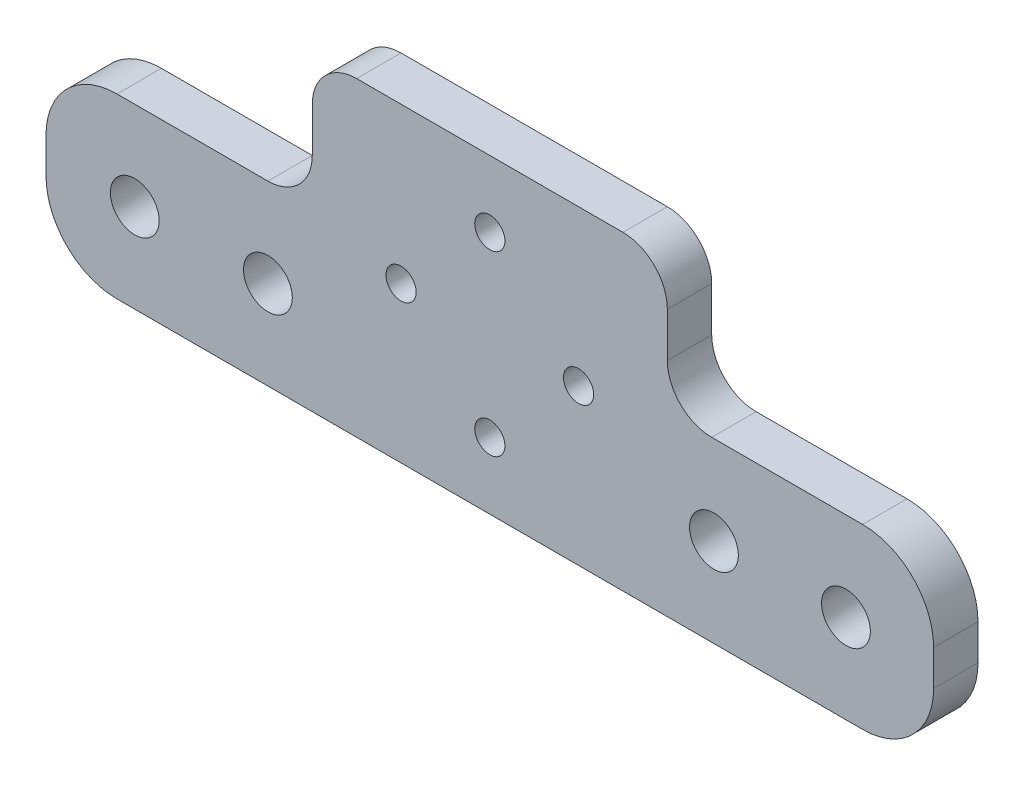
ISO-10303-21;
HEADER;
FILE_DESCRIPTION(('STEP AP214'),'2;1');
FILE_NAME('part.step','',(''),(''),'','','');
FILE_SCHEMA(('AUTOMOTIVE_DESIGN { 1 0 10303 214 1 1 1 1 }'));
ENDSEC;
DATA;
#1=APPLICATION_CONTEXT('core data for automotive mechanical design processes');
#2=APPLICATION_PROTOCOL_DEFINITION('international standard','automotive_design',2000,#1);
#3=PRODUCT_CONTEXT('',#1,'mechanical');
#4=PRODUCT('Part','Part','',(#3));
#5=PRODUCT_RELATED_PRODUCT_CATEGORY('part','',(#4));
#6=PRODUCT_DEFINITION_FORMATION('','',#4);
#7=PRODUCT_DEFINITION_CONTEXT('part definition',#1,'design');
#8=PRODUCT_DEFINITION('design','',#6,#7);
#9=PRODUCT_DEFINITION_SHAPE('','',#8);
#10=(LENGTH_UNIT() NAMED_UNIT(*) SI_UNIT(.MILLI.,.METRE.));
#11=(NAMED_UNIT(*) PLANE_ANGLE_UNIT() SI_UNIT($,.RADIAN.));
#12=(NAMED_UNIT(*) SI_UNIT($,.STERADIAN.) SOLID_ANGLE_UNIT());
#13=UNCERTAINTY_MEASURE_WITH_UNIT(LENGTH_MEASURE(1.E-05),#10,'distance_accuracy_value','');
#14=(GEOMETRIC_REPRESENTATION_CONTEXT(3) GLOBAL_UNCERTAINTY_ASSIGNED_CONTEXT((#13)) GLOBAL_UNIT_ASSIGNED_CONTEXT((#10,
#11,#12)) REPRESENTATION_CONTEXT('',''));
#15=CARTESIAN_POINT('',(0.,0.,0.));
#16=DIRECTION('',(0.,0.,1.));
#17=DIRECTION('',(1.,0.,0.));
#18=AXIS2_PLACEMENT_3D('',#15,#16,#17);
#19=CARTESIAN_POINT('',(-25.,25.,0.));
#20=DIRECTION('',(0.,0.,1.));
#21=DIRECTION('',(1.,0.,0.));
#22=AXIS2_PLACEMENT_3D('',#19,#20,#21);
#23=PLANE('',#22);
#24=CARTESIAN_POINT('',(0.,7.5,0.));
#25=DIRECTION('',(0.,0.,-1.));
#26=DIRECTION('',(-1.,0.,0.));
#27=AXIS2_PLACEMENT_3D('',#24,#25,#26);
#28=CIRCLE('',#27,3.15);
#29=CARTESIAN_POINT('',(-3.15,7.5,0.));
#30=VERTEX_POINT('',#29);
#31=EDGE_CURVE('E379',#30,#30,#28,.T.);
#32=ORIENTED_EDGE('',*,*,#31,.F.);
#33=EDGE_LOOP('',(#32));
#34=FACE_BOUND('',#33,.T.);
#35=CARTESIAN_POINT('',(-40.,9.99999999999996,0.));
#36=DIRECTION('',(0.,0.,1.));
#37=DIRECTION('',(1.,0.,0.));
#38=AXIS2_PLACEMENT_3D('',#35,#36,#37);
#39=CIRCLE('',#38,2.75);
#40=CARTESIAN_POINT('',(-37.25,9.99999999999996,0.));
#41=VERTEX_POINT('',#40);
#42=EDGE_CURVE('E409',#41,#41,#39,.T.);
#43=ORIENTED_EDGE('',*,*,#42,.T.);
#44=EDGE_LOOP('',(#43));
#45=FACE_BOUND('',#44,.T.);
#46=CARTESIAN_POINT('',(-25.,9.99999999999995,0.));
#47=DIRECTION('',(0.,0.,1.));
#48=DIRECTION('',(1.,0.,0.));
#49=AXIS2_PLACEMENT_3D('',#46,#47,#48);
#50=CIRCLE('',#49,2.74999999999999);
#51=CARTESIAN_POINT('',(-22.25,9.99999999999995,0.));
#52=VERTEX_POINT('',#51);
#53=EDGE_CURVE('E415',#52,#52,#50,.T.);
#54=ORIENTED_EDGE('',*,*,#53,.T.);
#55=EDGE_LOOP('',(#54));
#56=FACE_BOUND('',#55,.T.);
#57=CARTESIAN_POINT('',(25.25,9.99999999999995,0.));
#58=DIRECTION('',(0.,0.,1.));
#59=DIRECTION('',(1.,0.,0.));
#60=AXIS2_PLACEMENT_3D('',#57,#58,#59);
#61=CIRCLE('',#60,2.74999999999999);
#62=CARTESIAN_POINT('',(28.,9.99999999999995,0.));
#63=VERTEX_POINT('',#62);
#64=EDGE_CURVE('E421',#63,#63,#61,.T.);
#65=ORIENTED_EDGE('',*,*,#64,.T.);
#66=EDGE_LOOP('',(#65));
#67=FACE_BOUND('',#66,.T.);
#68=CARTESIAN_POINT('',(40.125,9.99999999999996,0.));
#69=DIRECTION('',(0.,0.,1.));
#70=DIRECTION('',(1.,0.,0.));
#71=AXIS2_PLACEMENT_3D('',#68,#69,#70);
#72=CIRCLE('',#71,2.74999999999999);
#73=CARTESIAN_POINT('',(42.875,9.99999999999996,0.));
#74=VERTEX_POINT('',#73);
#75=EDGE_CURVE('E182',#74,#74,#72,.T.);
#76=ORIENTED_EDGE('',*,*,#75,.T.);
#77=EDGE_LOOP('',(#76));
#78=FACE_BOUND('',#77,.T.);
#79=CARTESIAN_POINT('',(-25.,25.,0.));
#80=DIRECTION('',(0.,0.,-1.));
#81=DIRECTION('',(1.,0.,0.));
#82=AXIS2_PLACEMENT_3D('',#79,#80,#81);
#83=CIRCLE('',#82,5.);
#84=CARTESIAN_POINT('',(-20.,25.,0.));
#85=VERTEX_POINT('',#84);
#86=CARTESIAN_POINT('',(-25.,20.,0.));
#87=VERTEX_POINT('',#86);
#88=EDGE_CURVE('E178',#85,#87,#83,.T.);
#89=ORIENTED_EDGE('',*,*,#88,.F.);
#90=DIRECTION('',(0.,-1.,0.));
#91=VECTOR('',#90,1.);
#92=CARTESIAN_POINT('',(-20.,25.,0.));
#93=LINE('',#92,#91);
#94=CARTESIAN_POINT('',(-20.,30.,0.));
#95=VERTEX_POINT('',#94);
#96=EDGE_CURVE('E109',#95,#85,#93,.T.);
#97=ORIENTED_EDGE('',*,*,#96,.F.);
#98=CARTESIAN_POINT('',(-15.,30.,0.));
#99=DIRECTION('',(0.,0.,1.));
#100=DIRECTION('',(-1.,0.,0.));
#101=AXIS2_PLACEMENT_3D('',#98,#99,#100);
#102=CIRCLE('',#101,5.);
#103=CARTESIAN_POINT('',(-15.,35.,0.));
#104=VERTEX_POINT('',#103);
#105=EDGE_CURVE('E103',#104,#95,#102,.T.);
#106=ORIENTED_EDGE('',*,*,#105,.F.);
#107=DIRECTION('',(-1.,0.,0.));
#108=VECTOR('',#107,1.);
#109=CARTESIAN_POINT('',(-15.,35.,0.));
#110=LINE('',#109,#108);
#111=CARTESIAN_POINT('',(15.,35.,0.));
#112=VERTEX_POINT('',#111);
#113=EDGE_CURVE('E168',#112,#104,#110,.T.);
#114=ORIENTED_EDGE('',*,*,#113,.F.);
#115=CARTESIAN_POINT('',(15.,30.,0.));
#116=DIRECTION('',(0.,0.,1.));
#117=DIRECTION('',(1.,0.,0.));
#118=AXIS2_PLACEMENT_3D('',#115,#116,#117);
#119=CIRCLE('',#118,5.);
#120=CARTESIAN_POINT('',(20.,30.,0.));
#121=VERTEX_POINT('',#120);
#122=EDGE_CURVE('E204',#121,#112,#119,.T.);
#123=ORIENTED_EDGE('',*,*,#122,.F.);
#124=DIRECTION('',(0.,1.,0.));
#125=VECTOR('',#124,1.);
#126=CARTESIAN_POINT('',(20.,25.,0.));
#127=LINE('',#126,#125);
#128=CARTESIAN_POINT('',(20.,25.,0.));
#129=VERTEX_POINT('',#128);
#130=EDGE_CURVE('E202',#129,#121,#127,.T.);
#131=ORIENTED_EDGE('',*,*,#130,.F.);
#132=CARTESIAN_POINT('',(25.,25.,0.));
#133=DIRECTION('',(0.,0.,-1.));
#134=DIRECTION('',(-1.,0.,0.));
#135=AXIS2_PLACEMENT_3D('',#132,#133,#134);
#136=CIRCLE('',#135,5.);
#137=CARTESIAN_POINT('',(25.,20.,0.));
#138=VERTEX_POINT('',#137);
#139=EDGE_CURVE('E200',#138,#129,#136,.T.);
#140=ORIENTED_EDGE('',*,*,#139,.F.);
#141=DIRECTION('',(-1.,0.,0.));
#142=VECTOR('',#141,1.);
#143=CARTESIAN_POINT('',(42.,20.,0.));
#144=LINE('',#143,#142);
#145=CARTESIAN_POINT('',(42.,20.,0.));
#146=VERTEX_POINT('',#145);
#147=EDGE_CURVE('E198',#146,#138,#144,.T.);
#148=ORIENTED_EDGE('',*,*,#147,.F.);
#149=CARTESIAN_POINT('',(42.,12.,0.));
#150=DIRECTION('',(0.,0.,1.));
#151=DIRECTION('',(1.,0.,0.));
#152=AXIS2_PLACEMENT_3D('',#149,#150,#151);
#153=CIRCLE('',#152,8.);
#154=CARTESIAN_POINT('',(50.,11.9999999999999,0.));
#155=VERTEX_POINT('',#154);
#156=EDGE_CURVE('E196',#155,#146,#153,.T.);
#157=ORIENTED_EDGE('',*,*,#156,.F.);
#158=DIRECTION('',(0.,1.,0.));
#159=VECTOR('',#158,1.);
#160=CARTESIAN_POINT('',(50.,8.00000000000005,0.));
#161=LINE('',#160,#159);
#162=CARTESIAN_POINT('',(50.,7.99999999999999,0.));
#163=VERTEX_POINT('',#162);
#164=EDGE_CURVE('E194',#163,#155,#161,.T.);
#165=ORIENTED_EDGE('',*,*,#164,.F.);
#166=CARTESIAN_POINT('',(42.,7.99999999999999,0.));
#167=DIRECTION('',(0.,0.,1.));
#168=DIRECTION('',(1.,0.,0.));
#169=AXIS2_PLACEMENT_3D('',#166,#167,#168);
#170=CIRCLE('',#169,8.);
#171=CARTESIAN_POINT('',(42.,0.,0.));
#172=VERTEX_POINT('',#171);
#173=EDGE_CURVE('E192',#172,#163,#170,.T.);
#174=ORIENTED_EDGE('',*,*,#173,.F.);
#175=DIRECTION('',(1.,0.,0.));
#176=VECTOR('',#175,1.);
#177=CARTESIAN_POINT('',(42.,0.,0.));
#178=LINE('',#177,#176);
#179=CARTESIAN_POINT('',(-42.,0.,0.));
#180=VERTEX_POINT('',#179);
#181=EDGE_CURVE('E190',#180,#172,#178,.T.);
#182=ORIENTED_EDGE('',*,*,#181,.F.);
#183=CARTESIAN_POINT('',(-42.,7.99999999999999,0.));
#184=DIRECTION('',(0.,0.,1.));
#185=DIRECTION('',(-1.,0.,0.));
#186=AXIS2_PLACEMENT_3D('',#183,#184,#185);
#187=CIRCLE('',#186,8.);
#188=CARTESIAN_POINT('',(-50.,8.00000000000005,0.));
#189=VERTEX_POINT('',#188);
#190=EDGE_CURVE('E188',#189,#180,#187,.T.);
#191=ORIENTED_EDGE('',*,*,#190,.F.);
#192=DIRECTION('',(0.,-1.,0.));
#193=VECTOR('',#192,1.);
#194=CARTESIAN_POINT('',(-50.,8.00000000000005,0.));
#195=LINE('',#194,#193);
#196=CARTESIAN_POINT('',(-50.,11.9999999999999,0.));
#197=VERTEX_POINT('',#196);
#198=EDGE_CURVE('E186',#197,#189,#195,.T.);
#199=ORIENTED_EDGE('',*,*,#198,.F.);
#200=CARTESIAN_POINT('',(-42.,12.,0.));
#201=DIRECTION('',(0.,0.,1.));
#202=DIRECTION('',(-1.,0.,0.));
#203=AXIS2_PLACEMENT_3D('',#200,#201,#202);
#204=CIRCLE('',#203,8.);
#205=CARTESIAN_POINT('',(-42.,20.,0.));
#206=VERTEX_POINT('',#205);
#207=EDGE_CURVE('E184',#206,#197,#204,.T.);
#208=ORIENTED_EDGE('',*,*,#207,.F.);
#209=DIRECTION('',(-1.,0.,0.));
#210=VECTOR('',#209,1.);
#211=CARTESIAN_POINT('',(-42.,20.,0.));
#212=LINE('',#211,#210);
#213=EDGE_CURVE('E181',#87,#206,#212,.T.);
#214=ORIENTED_EDGE('',*,*,#213,.F.);
#215=EDGE_LOOP('',(#89,#97,#106,#114,#123,#131,#140,#148,#157,#165,#174,#182,#191,#199,#208,#214));
#216=FACE_BOUND('',#215,.T.);
#217=CARTESIAN_POINT('',(0.,27.5,0.));
#218=DIRECTION('',(0.,0.,-1.));
#219=DIRECTION('',(-1.,0.,0.));
#220=AXIS2_PLACEMENT_3D('',#217,#218,#219);
#221=CIRCLE('',#220,3.15);
#222=CARTESIAN_POINT('',(-3.15,27.5,0.));
#223=VERTEX_POINT('',#222);
#224=EDGE_CURVE('E397',#223,#223,#221,.T.);
#225=ORIENTED_EDGE('',*,*,#224,.F.);
#226=EDGE_LOOP('',(#225));
#227=FACE_BOUND('',#226,.T.);
#228=CARTESIAN_POINT('',(-10.,17.5,0.));
#229=DIRECTION('',(0.,0.,-1.));
#230=DIRECTION('',(-1.,0.,0.));
#231=AXIS2_PLACEMENT_3D('',#228,#229,#230);
#232=CIRCLE('',#231,3.15);
#233=CARTESIAN_POINT('',(-13.15,17.5,0.));
#234=VERTEX_POINT('',#233);
#235=EDGE_CURVE('E388',#234,#234,#232,.T.);
#236=ORIENTED_EDGE('',*,*,#235,.F.);
#237=EDGE_LOOP('',(#236));
#238=FACE_BOUND('',#237,.T.);
#239=CARTESIAN_POINT('',(10.,17.5,0.));
#240=DIRECTION('',(0.,0.,-1.));
#241=DIRECTION('',(-1.,0.,0.));
#242=AXIS2_PLACEMENT_3D('',#239,#240,#241);
#243=CIRCLE('',#242,3.15);
#244=CARTESIAN_POINT('',(6.85,17.5,0.));
#245=VERTEX_POINT('',#244);
#246=EDGE_CURVE('E371',#245,#245,#243,.T.);
#247=ORIENTED_EDGE('',*,*,#246,.F.);
#248=EDGE_LOOP('',(#247));
#249=FACE_BOUND('',#248,.T.);
#250=ADVANCED_FACE('F33',(#34,#45,#56,#67,#78,#216,#227,#238,#249),#23,.F.);
#251=CARTESIAN_POINT('',(-25.,25.,5.));
#252=DIRECTION('',(0.,0.,-1.));
#253=DIRECTION('',(-1.,0.,0.));
#254=AXIS2_PLACEMENT_3D('',#251,#252,#253);
#255=CYLINDRICAL_SURFACE('',#254,5.);
#256=ORIENTED_EDGE('',*,*,#88,.T.);
#257=DIRECTION('',(0.,0.,-1.));
#258=VECTOR('',#257,1.);
#259=CARTESIAN_POINT('',(-25.,20.,5.));
#260=LINE('',#259,#258);
#261=CARTESIAN_POINT('',(-25.,20.,5.));
#262=VERTEX_POINT('',#261);
#263=EDGE_CURVE('E11',#262,#87,#260,.T.);
#264=ORIENTED_EDGE('',*,*,#263,.F.);
#265=CARTESIAN_POINT('',(-25.,25.,5.));
#266=DIRECTION('',(0.,0.,-1.));
#267=DIRECTION('',(1.,0.,0.));
#268=AXIS2_PLACEMENT_3D('',#265,#266,#267);
#269=CIRCLE('',#268,5.);
#270=CARTESIAN_POINT('',(-20.,25.,5.));
#271=VERTEX_POINT('',#270);
#272=EDGE_CURVE('E209',#271,#262,#269,.T.);
#273=ORIENTED_EDGE('',*,*,#272,.F.);
#274=DIRECTION('',(0.,0.,-1.));
#275=VECTOR('',#274,1.);
#276=CARTESIAN_POINT('',(-20.,25.,5.));
#277=LINE('',#276,#275);
#278=EDGE_CURVE('E174',#271,#85,#277,.T.);
#279=ORIENTED_EDGE('',*,*,#278,.T.);
#280=EDGE_LOOP('',(#256,#264,#273,#279));
#281=FACE_BOUND('',#280,.T.);
#282=ADVANCED_FACE('F35',(#281),#255,.F.);
#283=CARTESIAN_POINT('',(-42.,20.,5.));
#284=DIRECTION('',(0.,-1.,0.));
#285=DIRECTION('',(1.,0.,0.));
#286=AXIS2_PLACEMENT_3D('',#283,#284,#285);
#287=PLANE('',#286);
#288=ORIENTED_EDGE('',*,*,#213,.T.);
#289=DIRECTION('',(0.,0.,-1.));
#290=VECTOR('',#289,1.);
#291=CARTESIAN_POINT('',(-42.,20.,5.));
#292=LINE('',#291,#290);
#293=CARTESIAN_POINT('',(-42.,20.,5.));
#294=VERTEX_POINT('',#293);
#295=EDGE_CURVE('E42',#294,#206,#292,.T.);
#296=ORIENTED_EDGE('',*,*,#295,.F.);
#297=DIRECTION('',(-1.,0.,0.));
#298=VECTOR('',#297,1.);
#299=CARTESIAN_POINT('',(-42.,20.,5.));
#300=LINE('',#299,#298);
#301=EDGE_CURVE('E117',#262,#294,#300,.T.);
#302=ORIENTED_EDGE('',*,*,#301,.F.);
#303=ORIENTED_EDGE('',*,*,#263,.T.);
#304=EDGE_LOOP('',(#288,#296,#302,#303));
#305=FACE_BOUND('',#304,.T.);
#306=ADVANCED_FACE('F313',(#305),#287,.F.);
#307=CARTESIAN_POINT('',(-42.,12.,5.));
#308=DIRECTION('',(0.,0.,-1.));
#309=DIRECTION('',(-1.,0.,0.));
#310=AXIS2_PLACEMENT_3D('',#307,#308,#309);
#311=CYLINDRICAL_SURFACE('',#310,8.);
#312=ORIENTED_EDGE('',*,*,#207,.T.);
#313=DIRECTION('',(0.,0.,-1.));
#314=VECTOR('',#313,1.);
#315=CARTESIAN_POINT('',(-50.,11.9999999999999,5.));
#316=LINE('',#315,#314);
#317=CARTESIAN_POINT('',(-50.,11.9999999999999,5.));
#318=VERTEX_POINT('',#317);
#319=EDGE_CURVE('E240',#318,#197,#316,.T.);
#320=ORIENTED_EDGE('',*,*,#319,.F.);
#321=CARTESIAN_POINT('',(-42.,12.,5.));
#322=DIRECTION('',(0.,0.,1.));
#323=DIRECTION('',(-1.,0.,0.));
#324=AXIS2_PLACEMENT_3D('',#321,#322,#323);
#325=CIRCLE('',#324,8.);
#326=EDGE_CURVE('E248',#294,#318,#325,.T.);
#327=ORIENTED_EDGE('',*,*,#326,.F.);
#328=ORIENTED_EDGE('',*,*,#295,.T.);
#329=EDGE_LOOP('',(#312,#320,#327,#328));
#330=FACE_BOUND('',#329,.T.);
#331=ADVANCED_FACE('F246',(#330),#311,.T.);
#332=CARTESIAN_POINT('',(-50.,8.00000000000005,5.));
#333=DIRECTION('',(1.,0.,0.));
#334=DIRECTION('',(0.,0.,-1.));
#335=AXIS2_PLACEMENT_3D('',#332,#333,#334);
#336=PLANE('',#335);
#337=ORIENTED_EDGE('',*,*,#198,.T.);
#338=DIRECTION('',(0.,0.,-1.));
#339=VECTOR('',#338,1.);
#340=CARTESIAN_POINT('',(-50.,8.00000000000005,5.));
#341=LINE('',#340,#339);
#342=CARTESIAN_POINT('',(-50.,8.00000000000005,5.));
#343=VERTEX_POINT('',#342);
#344=EDGE_CURVE('E237',#343,#189,#341,.T.);
#345=ORIENTED_EDGE('',*,*,#344,.F.);
#346=DIRECTION('',(0.,-1.,0.));
#347=VECTOR('',#346,1.);
#348=CARTESIAN_POINT('',(-50.,8.00000000000005,5.));
#349=LINE('',#348,#347);
#350=EDGE_CURVE('E266',#318,#343,#349,.T.);
#351=ORIENTED_EDGE('',*,*,#350,.F.);
#352=ORIENTED_EDGE('',*,*,#319,.T.);
#353=EDGE_LOOP('',(#337,#345,#351,#352));
#354=FACE_BOUND('',#353,.T.);
#355=ADVANCED_FACE('F257',(#354),#336,.F.);
#356=CARTESIAN_POINT('',(-42.,7.99999999999999,5.));
#357=DIRECTION('',(0.,0.,-1.));
#358=DIRECTION('',(-1.,0.,0.));
#359=AXIS2_PLACEMENT_3D('',#356,#357,#358);
#360=CYLINDRICAL_SURFACE('',#359,8.);
#361=ORIENTED_EDGE('',*,*,#190,.T.);
#362=DIRECTION('',(0.,0.,-1.));
#363=VECTOR('',#362,1.);
#364=CARTESIAN_POINT('',(-42.,0.,5.));
#365=LINE('',#364,#363);
#366=CARTESIAN_POINT('',(-42.,0.,5.));
#367=VERTEX_POINT('',#366);
#368=EDGE_CURVE('E234',#367,#180,#365,.T.);
#369=ORIENTED_EDGE('',*,*,#368,.F.);
#370=CARTESIAN_POINT('',(-42.,7.99999999999999,5.));
#371=DIRECTION('',(0.,0.,1.));
#372=DIRECTION('',(-1.,0.,0.));
#373=AXIS2_PLACEMENT_3D('',#370,#371,#372);
#374=CIRCLE('',#373,8.);
#375=EDGE_CURVE('E263',#343,#367,#374,.T.);
#376=ORIENTED_EDGE('',*,*,#375,.F.);
#377=ORIENTED_EDGE('',*,*,#344,.T.);
#378=EDGE_LOOP('',(#361,#369,#376,#377));
#379=FACE_BOUND('',#378,.T.);
#380=ADVANCED_FACE('F261',(#379),#360,.T.);
#381=CARTESIAN_POINT('',(42.,0.,5.));
#382=DIRECTION('',(0.,1.,0.));
#383=DIRECTION('',(0.,0.,1.));
#384=AXIS2_PLACEMENT_3D('',#381,#382,#383);
#385=PLANE('',#384);
#386=ORIENTED_EDGE('',*,*,#181,.T.);
#387=DIRECTION('',(0.,0.,-1.));
#388=VECTOR('',#387,1.);
#389=CARTESIAN_POINT('',(42.,0.,5.));
#390=LINE('',#389,#388);
#391=CARTESIAN_POINT('',(42.,0.,5.));
#392=VERTEX_POINT('',#391);
#393=EDGE_CURVE('E231',#392,#172,#390,.T.);
#394=ORIENTED_EDGE('',*,*,#393,.F.);
#395=DIRECTION('',(1.,0.,0.));
#396=VECTOR('',#395,1.);
#397=CARTESIAN_POINT('',(42.,0.,5.));
#398=LINE('',#397,#396);
#399=EDGE_CURVE('E265',#367,#392,#398,.T.);
#400=ORIENTED_EDGE('',*,*,#399,.F.);
#401=ORIENTED_EDGE('',*,*,#368,.T.);
#402=EDGE_LOOP('',(#386,#394,#400,#401));
#403=FACE_BOUND('',#402,.T.);
#404=ADVANCED_FACE('F622',(#403),#385,.F.);
#405=CARTESIAN_POINT('',(42.,7.99999999999999,5.));
#406=DIRECTION('',(0.,0.,-1.));
#407=DIRECTION('',(-1.,0.,0.));
#408=AXIS2_PLACEMENT_3D('',#405,#406,#407);
#409=CYLINDRICAL_SURFACE('',#408,8.);
#410=ORIENTED_EDGE('',*,*,#173,.T.);
#411=DIRECTION('',(0.,0.,-1.));
#412=VECTOR('',#411,1.);
#413=CARTESIAN_POINT('',(50.,7.99999999999999,5.));
#414=LINE('',#413,#412);
#415=CARTESIAN_POINT('',(50.,7.99999999999999,5.));
#416=VERTEX_POINT('',#415);
#417=EDGE_CURVE('E228',#416,#163,#414,.T.);
#418=ORIENTED_EDGE('',*,*,#417,.F.);
#419=CARTESIAN_POINT('',(42.,7.99999999999999,5.));
#420=DIRECTION('',(0.,0.,1.));
#421=DIRECTION('',(1.,0.,0.));
#422=AXIS2_PLACEMENT_3D('',#419,#420,#421);
#423=CIRCLE('',#422,8.);
#424=EDGE_CURVE('E268',#392,#416,#423,.T.);
#425=ORIENTED_EDGE('',*,*,#424,.F.);
#426=ORIENTED_EDGE('',*,*,#393,.T.);
#427=EDGE_LOOP('',(#410,#418,#425,#426));
#428=FACE_BOUND('',#427,.T.);
#429=ADVANCED_FACE('F613',(#428),#409,.T.);
#430=CARTESIAN_POINT('',(50.,8.00000000000005,5.));
#431=DIRECTION('',(-1.,0.,0.));
#432=DIRECTION('',(0.,0.,1.));
#433=AXIS2_PLACEMENT_3D('',#430,#431,#432);
#434=PLANE('',#433);
#435=ORIENTED_EDGE('',*,*,#164,.T.);
#436=DIRECTION('',(0.,0.,-1.));
#437=VECTOR('',#436,1.);
#438=CARTESIAN_POINT('',(50.,11.9999999999999,5.));
#439=LINE('',#438,#437);
#440=CARTESIAN_POINT('',(50.,11.9999999999999,5.));
#441=VERTEX_POINT('',#440);
#442=EDGE_CURVE('E225',#441,#155,#439,.T.);
#443=ORIENTED_EDGE('',*,*,#442,.F.);
#444=DIRECTION('',(0.,1.,0.));
#445=VECTOR('',#444,1.);
#446=CARTESIAN_POINT('',(50.,8.00000000000005,5.));
#447=LINE('',#446,#445);
#448=EDGE_CURVE('E274',#416,#441,#447,.T.);
#449=ORIENTED_EDGE('',*,*,#448,.F.);
#450=ORIENTED_EDGE('',*,*,#417,.T.);
#451=EDGE_LOOP('',(#435,#443,#449,#450));
#452=FACE_BOUND('',#451,.T.);
#453=ADVANCED_FACE('F604',(#452),#434,.F.);
#454=CARTESIAN_POINT('',(42.,12.,5.));
#455=DIRECTION('',(0.,0.,-1.));
#456=DIRECTION('',(-1.,0.,0.));
#457=AXIS2_PLACEMENT_3D('',#454,#455,#456);
#458=CYLINDRICAL_SURFACE('',#457,8.);
#459=ORIENTED_EDGE('',*,*,#156,.T.);
#460=DIRECTION('',(0.,0.,-1.));
#461=VECTOR('',#460,1.);
#462=CARTESIAN_POINT('',(42.,20.,5.));
#463=LINE('',#462,#461);
#464=CARTESIAN_POINT('',(42.,20.,5.));
#465=VERTEX_POINT('',#464);
#466=EDGE_CURVE('E222',#465,#146,#463,.T.);
#467=ORIENTED_EDGE('',*,*,#466,.F.);
#468=CARTESIAN_POINT('',(42.,12.,5.));
#469=DIRECTION('',(0.,0.,1.));
#470=DIRECTION('',(1.,0.,0.));
#471=AXIS2_PLACEMENT_3D('',#468,#469,#470);
#472=CIRCLE('',#471,8.);
#473=EDGE_CURVE('E276',#441,#465,#472,.T.);
#474=ORIENTED_EDGE('',*,*,#473,.F.);
#475=ORIENTED_EDGE('',*,*,#442,.T.);
#476=EDGE_LOOP('',(#459,#467,#474,#475));
#477=FACE_BOUND('',#476,.T.);
#478=ADVANCED_FACE('F595',(#477),#458,.T.);
#479=CARTESIAN_POINT('',(42.,20.,5.));
#480=DIRECTION('',(0.,-1.,0.));
#481=DIRECTION('',(1.,0.,0.));
#482=AXIS2_PLACEMENT_3D('',#479,#480,#481);
#483=PLANE('',#482);
#484=ORIENTED_EDGE('',*,*,#147,.T.);
#485=DIRECTION('',(0.,0.,-1.));
#486=VECTOR('',#485,1.);
#487=CARTESIAN_POINT('',(25.,20.,5.));
#488=LINE('',#487,#486);
#489=CARTESIAN_POINT('',(25.,20.,5.));
#490=VERTEX_POINT('',#489);
#491=EDGE_CURVE('E219',#490,#138,#488,.T.);
#492=ORIENTED_EDGE('',*,*,#491,.F.);
#493=DIRECTION('',(-1.,0.,0.));
#494=VECTOR('',#493,1.);
#495=CARTESIAN_POINT('',(42.,20.,5.));
#496=LINE('',#495,#494);
#497=EDGE_CURVE('E278',#465,#490,#496,.T.);
#498=ORIENTED_EDGE('',*,*,#497,.F.);
#499=ORIENTED_EDGE('',*,*,#466,.T.);
#500=EDGE_LOOP('',(#484,#492,#498,#499));
#501=FACE_BOUND('',#500,.T.);
#502=ADVANCED_FACE('F586',(#501),#483,.F.);
#503=CARTESIAN_POINT('',(25.,25.,5.));
#504=DIRECTION('',(0.,0.,-1.));
#505=DIRECTION('',(-1.,0.,0.));
#506=AXIS2_PLACEMENT_3D('',#503,#504,#505);
#507=CYLINDRICAL_SURFACE('',#506,5.);
#508=ORIENTED_EDGE('',*,*,#139,.T.);
#509=DIRECTION('',(0.,0.,-1.));
#510=VECTOR('',#509,1.);
#511=CARTESIAN_POINT('',(20.,25.,5.));
#512=LINE('',#511,#510);
#513=CARTESIAN_POINT('',(20.,25.,5.));
#514=VERTEX_POINT('',#513);
#515=EDGE_CURVE('E216',#514,#129,#512,.T.);
#516=ORIENTED_EDGE('',*,*,#515,.F.);
#517=CARTESIAN_POINT('',(25.,25.,5.));
#518=DIRECTION('',(0.,0.,-1.));
#519=DIRECTION('',(-1.,0.,0.));
#520=AXIS2_PLACEMENT_3D('',#517,#518,#519);
#521=CIRCLE('',#520,5.);
#522=EDGE_CURVE('E280',#490,#514,#521,.T.);
#523=ORIENTED_EDGE('',*,*,#522,.F.);
#524=ORIENTED_EDGE('',*,*,#491,.T.);
#525=EDGE_LOOP('',(#508,#516,#523,#524));
#526=FACE_BOUND('',#525,.T.);
#527=ADVANCED_FACE('F578',(#526),#507,.F.);
#528=CARTESIAN_POINT('',(20.,25.,5.));
#529=DIRECTION('',(-1.,0.,0.));
#530=DIRECTION('',(0.,0.,1.));
#531=AXIS2_PLACEMENT_3D('',#528,#529,#530);
#532=PLANE('',#531);
#533=ORIENTED_EDGE('',*,*,#130,.T.);
#534=DIRECTION('',(0.,0.,-1.));
#535=VECTOR('',#534,1.);
#536=CARTESIAN_POINT('',(20.,30.,5.));
#537=LINE('',#536,#535);
#538=CARTESIAN_POINT('',(20.,30.,5.));
#539=VERTEX_POINT('',#538);
#540=EDGE_CURVE('E213',#539,#121,#537,.T.);
#541=ORIENTED_EDGE('',*,*,#540,.F.);
#542=DIRECTION('',(0.,1.,0.));
#543=VECTOR('',#542,1.);
#544=CARTESIAN_POINT('',(20.,25.,5.));
#545=LINE('',#544,#543);
#546=EDGE_CURVE('E282',#514,#539,#545,.T.);
#547=ORIENTED_EDGE('',*,*,#546,.F.);
#548=ORIENTED_EDGE('',*,*,#515,.T.);
#549=EDGE_LOOP('',(#533,#541,#547,#548));
#550=FACE_BOUND('',#549,.T.);
#551=ADVANCED_FACE('F288',(#550),#532,.F.);
#552=CARTESIAN_POINT('',(15.,30.,5.));
#553=DIRECTION('',(0.,0.,-1.));
#554=DIRECTION('',(-1.,0.,0.));
#555=AXIS2_PLACEMENT_3D('',#552,#553,#554);
#556=CYLINDRICAL_SURFACE('',#555,5.);
#557=ORIENTED_EDGE('',*,*,#122,.T.);
#558=DIRECTION('',(0.,0.,-1.));
#559=VECTOR('',#558,1.);
#560=CARTESIAN_POINT('',(15.,35.,5.));
#561=LINE('',#560,#559);
#562=CARTESIAN_POINT('',(15.,35.,5.));
#563=VERTEX_POINT('',#562);
#564=EDGE_CURVE('E169',#563,#112,#561,.T.);
#565=ORIENTED_EDGE('',*,*,#564,.F.);
#566=CARTESIAN_POINT('',(15.,30.,5.));
#567=DIRECTION('',(0.,0.,1.));
#568=DIRECTION('',(1.,0.,0.));
#569=AXIS2_PLACEMENT_3D('',#566,#567,#568);
#570=CIRCLE('',#569,5.);
#571=EDGE_CURVE('E160',#539,#563,#570,.T.);
#572=ORIENTED_EDGE('',*,*,#571,.F.);
#573=ORIENTED_EDGE('',*,*,#540,.T.);
#574=EDGE_LOOP('',(#557,#565,#572,#573));
#575=FACE_BOUND('',#574,.T.);
#576=ADVANCED_FACE('F292',(#575),#556,.T.);
#577=CARTESIAN_POINT('',(-15.,35.,5.));
#578=DIRECTION('',(0.,-1.,0.));
#579=DIRECTION('',(0.,0.,-1.));
#580=AXIS2_PLACEMENT_3D('',#577,#578,#579);
#581=PLANE('',#580);
#582=ORIENTED_EDGE('',*,*,#113,.T.);
#583=DIRECTION('',(0.,0.,-1.));
#584=VECTOR('',#583,1.);
#585=CARTESIAN_POINT('',(-15.,35.,5.));
#586=LINE('',#585,#584);
#587=CARTESIAN_POINT('',(-15.,35.,5.));
#588=VERTEX_POINT('',#587);
#589=EDGE_CURVE('E165',#588,#104,#586,.T.);
#590=ORIENTED_EDGE('',*,*,#589,.F.);
#591=DIRECTION('',(-1.,0.,0.));
#592=VECTOR('',#591,1.);
#593=CARTESIAN_POINT('',(-15.,35.,5.));
#594=LINE('',#593,#592);
#595=EDGE_CURVE('E154',#563,#588,#594,.T.);
#596=ORIENTED_EDGE('',*,*,#595,.F.);
#597=ORIENTED_EDGE('',*,*,#564,.T.);
#598=EDGE_LOOP('',(#582,#590,#596,#597));
#599=FACE_BOUND('',#598,.T.);
#600=ADVANCED_FACE('F166',(#599),#581,.F.);
#601=CARTESIAN_POINT('',(-15.,30.,5.));
#602=DIRECTION('',(0.,0.,-1.));
#603=DIRECTION('',(-1.,0.,0.));
#604=AXIS2_PLACEMENT_3D('',#601,#602,#603);
#605=CYLINDRICAL_SURFACE('',#604,5.);
#606=ORIENTED_EDGE('',*,*,#105,.T.);
#607=DIRECTION('',(0.,0.,-1.));
#608=VECTOR('',#607,1.);
#609=CARTESIAN_POINT('',(-20.,30.,5.));
#610=LINE('',#609,#608);
#611=CARTESIAN_POINT('',(-20.,30.,5.));
#612=VERTEX_POINT('',#611);
#613=EDGE_CURVE('E170',#612,#95,#610,.T.);
#614=ORIENTED_EDGE('',*,*,#613,.F.);
#615=CARTESIAN_POINT('',(-15.,30.,5.));
#616=DIRECTION('',(0.,0.,1.));
#617=DIRECTION('',(-1.,0.,0.));
#618=AXIS2_PLACEMENT_3D('',#615,#616,#617);
#619=CIRCLE('',#618,5.);
#620=EDGE_CURVE('E158',#588,#612,#619,.T.);
#621=ORIENTED_EDGE('',*,*,#620,.F.);
#622=ORIENTED_EDGE('',*,*,#589,.T.);
#623=EDGE_LOOP('',(#606,#614,#621,#622));
#624=FACE_BOUND('',#623,.T.);
#625=ADVANCED_FACE('F172',(#624),#605,.T.);
#626=CARTESIAN_POINT('',(-20.,25.,5.));
#627=DIRECTION('',(1.,0.,0.));
#628=DIRECTION('',(0.,0.,-1.));
#629=AXIS2_PLACEMENT_3D('',#626,#627,#628);
#630=PLANE('',#629);
#631=ORIENTED_EDGE('',*,*,#96,.T.);
#632=ORIENTED_EDGE('',*,*,#278,.F.);
#633=DIRECTION('',(0.,-1.,0.));
#634=VECTOR('',#633,1.);
#635=CARTESIAN_POINT('',(-20.,25.,5.));
#636=LINE('',#635,#634);
#637=EDGE_CURVE('E50',#612,#271,#636,.T.);
#638=ORIENTED_EDGE('',*,*,#637,.F.);
#639=ORIENTED_EDGE('',*,*,#613,.T.);
#640=EDGE_LOOP('',(#631,#632,#638,#639));
#641=FACE_BOUND('',#640,.T.);
#642=ADVANCED_FACE('F296',(#641),#630,.F.);
#643=CARTESIAN_POINT('',(-25.,25.,5.));
#644=DIRECTION('',(0.,0.,1.));
#645=DIRECTION('',(1.,0.,0.));
#646=AXIS2_PLACEMENT_3D('',#643,#644,#645);
#647=PLANE('',#646);
#648=CARTESIAN_POINT('',(10.,17.5,5.));
#649=DIRECTION('',(0.,0.,1.));
#650=DIRECTION('',(1.,0.,0.));
#651=AXIS2_PLACEMENT_3D('',#648,#649,#650);
#652=CIRCLE('',#651,1.7);
#653=CARTESIAN_POINT('',(11.7,17.5,5.));
#654=VERTEX_POINT('',#653);
#655=EDGE_CURVE('E374',#654,#654,#652,.T.);
#656=ORIENTED_EDGE('',*,*,#655,.F.);
#657=EDGE_LOOP('',(#656));
#658=FACE_BOUND('',#657,.T.);
#659=CARTESIAN_POINT('',(0.,7.5,5.));
#660=DIRECTION('',(0.,0.,1.));
#661=DIRECTION('',(1.,0.,0.));
#662=AXIS2_PLACEMENT_3D('',#659,#660,#661);
#663=CIRCLE('',#662,1.7);
#664=CARTESIAN_POINT('',(1.7,7.5,5.));
#665=VERTEX_POINT('',#664);
#666=EDGE_CURVE('E385',#665,#665,#663,.T.);
#667=ORIENTED_EDGE('',*,*,#666,.F.);
#668=EDGE_LOOP('',(#667));
#669=FACE_BOUND('',#668,.T.);
#670=CARTESIAN_POINT('',(-10.,17.5,5.));
#671=DIRECTION('',(0.,0.,1.));
#672=DIRECTION('',(1.,0.,0.));
#673=AXIS2_PLACEMENT_3D('',#670,#671,#672);
#674=CIRCLE('',#673,1.7);
#675=CARTESIAN_POINT('',(-8.3,17.5,5.));
#676=VERTEX_POINT('',#675);
#677=EDGE_CURVE('E394',#676,#676,#674,.T.);
#678=ORIENTED_EDGE('',*,*,#677,.F.);
#679=EDGE_LOOP('',(#678));
#680=FACE_BOUND('',#679,.T.);
#681=CARTESIAN_POINT('',(0.,27.5,5.));
#682=DIRECTION('',(0.,0.,1.));
#683=DIRECTION('',(1.,0.,0.));
#684=AXIS2_PLACEMENT_3D('',#681,#682,#683);
#685=CIRCLE('',#684,1.7);
#686=CARTESIAN_POINT('',(1.7,27.5,5.));
#687=VERTEX_POINT('',#686);
#688=EDGE_CURVE('E403',#687,#687,#685,.T.);
#689=ORIENTED_EDGE('',*,*,#688,.F.);
#690=EDGE_LOOP('',(#689));
#691=FACE_BOUND('',#690,.T.);
#692=CARTESIAN_POINT('',(-40.,9.99999999999996,5.));
#693=DIRECTION('',(0.,0.,1.));
#694=DIRECTION('',(1.,0.,0.));
#695=AXIS2_PLACEMENT_3D('',#692,#693,#694);
#696=CIRCLE('',#695,2.74999999999999);
#697=CARTESIAN_POINT('',(-37.25,9.99999999999996,5.));
#698=VERTEX_POINT('',#697);
#699=EDGE_CURVE('E406',#698,#698,#696,.T.);
#700=ORIENTED_EDGE('',*,*,#699,.F.);
#701=EDGE_LOOP('',(#700));
#702=FACE_BOUND('',#701,.T.);
#703=CARTESIAN_POINT('',(-25.,9.99999999999995,5.));
#704=DIRECTION('',(0.,0.,1.));
#705=DIRECTION('',(1.,0.,0.));
#706=AXIS2_PLACEMENT_3D('',#703,#704,#705);
#707=CIRCLE('',#706,2.74999999999999);
#708=CARTESIAN_POINT('',(-22.25,9.99999999999995,5.));
#709=VERTEX_POINT('',#708);
#710=EDGE_CURVE('E412',#709,#709,#707,.T.);
#711=ORIENTED_EDGE('',*,*,#710,.F.);
#712=EDGE_LOOP('',(#711));
#713=FACE_BOUND('',#712,.T.);
#714=CARTESIAN_POINT('',(25.25,9.99999999999995,5.));
#715=DIRECTION('',(0.,0.,1.));
#716=DIRECTION('',(1.,0.,0.));
#717=AXIS2_PLACEMENT_3D('',#714,#715,#716);
#718=CIRCLE('',#717,2.74999999999999);
#719=CARTESIAN_POINT('',(28.,9.99999999999995,5.));
#720=VERTEX_POINT('',#719);
#721=EDGE_CURVE('E418',#720,#720,#718,.T.);
#722=ORIENTED_EDGE('',*,*,#721,.F.);
#723=EDGE_LOOP('',(#722));
#724=FACE_BOUND('',#723,.T.);
#725=CARTESIAN_POINT('',(40.125,9.99999999999996,5.));
#726=DIRECTION('',(0.,0.,1.));
#727=DIRECTION('',(1.,0.,0.));
#728=AXIS2_PLACEMENT_3D('',#725,#726,#727);
#729=CIRCLE('',#728,2.74999999999999);
#730=CARTESIAN_POINT('',(42.875,9.99999999999996,5.));
#731=VERTEX_POINT('',#730);
#732=EDGE_CURVE('E424',#731,#731,#729,.T.);
#733=ORIENTED_EDGE('',*,*,#732,.F.);
#734=EDGE_LOOP('',(#733));
#735=FACE_BOUND('',#734,.T.);
#736=ORIENTED_EDGE('',*,*,#272,.T.);
#737=ORIENTED_EDGE('',*,*,#301,.T.);
#738=ORIENTED_EDGE('',*,*,#326,.T.);
#739=ORIENTED_EDGE('',*,*,#350,.T.);
#740=ORIENTED_EDGE('',*,*,#375,.T.);
#741=ORIENTED_EDGE('',*,*,#399,.T.);
#742=ORIENTED_EDGE('',*,*,#424,.T.);
#743=ORIENTED_EDGE('',*,*,#448,.T.);
#744=ORIENTED_EDGE('',*,*,#473,.T.);
#745=ORIENTED_EDGE('',*,*,#497,.T.);
#746=ORIENTED_EDGE('',*,*,#522,.T.);
#747=ORIENTED_EDGE('',*,*,#546,.T.);
#748=ORIENTED_EDGE('',*,*,#571,.T.);
#749=ORIENTED_EDGE('',*,*,#595,.T.);
#750=ORIENTED_EDGE('',*,*,#620,.T.);
#751=ORIENTED_EDGE('',*,*,#637,.T.);
#752=EDGE_LOOP('',(#736,#737,#738,#739,#740,#741,#742,#743,#744,#745,#746,#747,#748,#749,#750,#751));
#753=FACE_BOUND('',#752,.T.);
#754=ADVANCED_FACE('F156',(#658,#669,#680,#691,#702,#713,#724,#735,#753),#647,.T.);
#755=CARTESIAN_POINT('',(40.125,9.99999999999996,5.));
#756=DIRECTION('',(0.,0.,1.));
#757=DIRECTION('',(1.,0.,0.));
#758=AXIS2_PLACEMENT_3D('',#755,#756,#757);
#759=CYLINDRICAL_SURFACE('',#758,2.74999999999999);
#760=ORIENTED_EDGE('',*,*,#75,.F.);
#761=EDGE_LOOP('',(#760));
#762=FACE_BOUND('',#761,.T.);
#763=ORIENTED_EDGE('',*,*,#732,.T.);
#764=EDGE_LOOP('',(#763));
#765=FACE_BOUND('',#764,.T.);
#766=ADVANCED_FACE('F303',(#762,#765),#759,.F.);
#767=CARTESIAN_POINT('',(25.25,9.99999999999995,5.));
#768=DIRECTION('',(0.,0.,1.));
#769=DIRECTION('',(1.,0.,0.));
#770=AXIS2_PLACEMENT_3D('',#767,#768,#769);
#771=CYLINDRICAL_SURFACE('',#770,2.74999999999999);
#772=ORIENTED_EDGE('',*,*,#64,.F.);
#773=EDGE_LOOP('',(#772));
#774=FACE_BOUND('',#773,.T.);
#775=ORIENTED_EDGE('',*,*,#721,.T.);
#776=EDGE_LOOP('',(#775));
#777=FACE_BOUND('',#776,.T.);
#778=ADVANCED_FACE('F319',(#774,#777),#771,.F.);
#779=CARTESIAN_POINT('',(-25.,9.99999999999995,5.));
#780=DIRECTION('',(0.,0.,1.));
#781=DIRECTION('',(1.,0.,0.));
#782=AXIS2_PLACEMENT_3D('',#779,#780,#781);
#783=CYLINDRICAL_SURFACE('',#782,2.74999999999999);
#784=ORIENTED_EDGE('',*,*,#53,.F.);
#785=EDGE_LOOP('',(#784));
#786=FACE_BOUND('',#785,.T.);
#787=ORIENTED_EDGE('',*,*,#710,.T.);
#788=EDGE_LOOP('',(#787));
#789=FACE_BOUND('',#788,.T.);
#790=ADVANCED_FACE('F323',(#786,#789),#783,.F.);
#791=CARTESIAN_POINT('',(-40.,9.99999999999996,5.));
#792=DIRECTION('',(0.,0.,1.));
#793=DIRECTION('',(1.,0.,0.));
#794=AXIS2_PLACEMENT_3D('',#791,#792,#793);
#795=CYLINDRICAL_SURFACE('',#794,2.75);
#796=ORIENTED_EDGE('',*,*,#42,.F.);
#797=EDGE_LOOP('',(#796));
#798=FACE_BOUND('',#797,.T.);
#799=ORIENTED_EDGE('',*,*,#699,.T.);
#800=EDGE_LOOP('',(#799));
#801=FACE_BOUND('',#800,.T.);
#802=ADVANCED_FACE('F327',(#798,#801),#795,.F.);
#803=CARTESIAN_POINT('',(0.,27.5,0.));
#804=DIRECTION('',(0.,0.,-1.));
#805=DIRECTION('',(-1.,0.,0.));
#806=AXIS2_PLACEMENT_3D('',#803,#804,#805);
#807=CYLINDRICAL_SURFACE('',#806,1.7);
#808=CARTESIAN_POINT('',(0.,27.5,1.45));
#809=DIRECTION('',(0.,0.,-1.));
#810=DIRECTION('',(-1.,0.,0.));
#811=AXIS2_PLACEMENT_3D('',#808,#809,#810);
#812=CIRCLE('',#811,1.7);
#813=CARTESIAN_POINT('',(-1.7,27.5,1.45));
#814=VERTEX_POINT('',#813);
#815=EDGE_CURVE('E400',#814,#814,#812,.T.);
#816=ORIENTED_EDGE('',*,*,#815,.T.);
#817=EDGE_LOOP('',(#816));
#818=FACE_BOUND('',#817,.T.);
#819=ORIENTED_EDGE('',*,*,#688,.T.);
#820=EDGE_LOOP('',(#819));
#821=FACE_BOUND('',#820,.T.);
#822=ADVANCED_FACE('F331',(#818,#821),#807,.F.);
#823=CARTESIAN_POINT('',(0.,27.5,0.));
#824=DIRECTION('',(0.,0.,-1.));
#825=DIRECTION('',(-1.,0.,0.));
#826=AXIS2_PLACEMENT_3D('',#823,#824,#825);
#827=CONICAL_SURFACE('',#826,3.15,0.785398163397447);
#828=ORIENTED_EDGE('',*,*,#815,.F.);
#829=EDGE_LOOP('',(#828));
#830=FACE_BOUND('',#829,.T.);
#831=ORIENTED_EDGE('',*,*,#224,.T.);
#832=EDGE_LOOP('',(#831));
#833=FACE_BOUND('',#832,.T.);
#834=ADVANCED_FACE('F335',(#830,#833),#827,.F.);
#835=CARTESIAN_POINT('',(-10.,17.5,0.));
#836=DIRECTION('',(0.,0.,-1.));
#837=DIRECTION('',(-1.,0.,0.));
#838=AXIS2_PLACEMENT_3D('',#835,#836,#837);
#839=CYLINDRICAL_SURFACE('',#838,1.7);
#840=CARTESIAN_POINT('',(-10.,17.5,1.45));
#841=DIRECTION('',(0.,0.,-1.));
#842=DIRECTION('',(-1.,0.,0.));
#843=AXIS2_PLACEMENT_3D('',#840,#841,#842);
#844=CIRCLE('',#843,1.7);
#845=CARTESIAN_POINT('',(-11.7,17.5,1.45));
#846=VERTEX_POINT('',#845);
#847=EDGE_CURVE('E391',#846,#846,#844,.T.);
#848=ORIENTED_EDGE('',*,*,#847,.T.);
#849=EDGE_LOOP('',(#848));
#850=FACE_BOUND('',#849,.T.);
#851=ORIENTED_EDGE('',*,*,#677,.T.);
#852=EDGE_LOOP('',(#851));
#853=FACE_BOUND('',#852,.T.);
#854=ADVANCED_FACE('F339',(#850,#853),#839,.F.);
#855=CARTESIAN_POINT('',(-10.,17.5,0.));
#856=DIRECTION('',(0.,0.,-1.));
#857=DIRECTION('',(-1.,0.,0.));
#858=AXIS2_PLACEMENT_3D('',#855,#856,#857);
#859=CONICAL_SURFACE('',#858,3.15,0.785398163397448);
#860=ORIENTED_EDGE('',*,*,#847,.F.);
#861=EDGE_LOOP('',(#860));
#862=FACE_BOUND('',#861,.T.);
#863=ORIENTED_EDGE('',*,*,#235,.T.);
#864=EDGE_LOOP('',(#863));
#865=FACE_BOUND('',#864,.T.);
#866=ADVANCED_FACE('F343',(#862,#865),#859,.F.);
#867=CARTESIAN_POINT('',(0.,7.5,0.));
#868=DIRECTION('',(0.,0.,-1.));
#869=DIRECTION('',(-1.,0.,0.));
#870=AXIS2_PLACEMENT_3D('',#867,#868,#869);
#871=CYLINDRICAL_SURFACE('',#870,1.7);
#872=CARTESIAN_POINT('',(0.,7.5,1.45));
#873=DIRECTION('',(0.,0.,-1.));
#874=DIRECTION('',(-1.,0.,0.));
#875=AXIS2_PLACEMENT_3D('',#872,#873,#874);
#876=CIRCLE('',#875,1.7);
#877=CARTESIAN_POINT('',(-1.7,7.5,1.45));
#878=VERTEX_POINT('',#877);
#879=EDGE_CURVE('E382',#878,#878,#876,.T.);
#880=ORIENTED_EDGE('',*,*,#879,.T.);
#881=EDGE_LOOP('',(#880));
#882=FACE_BOUND('',#881,.T.);
#883=ORIENTED_EDGE('',*,*,#666,.T.);
#884=EDGE_LOOP('',(#883));
#885=FACE_BOUND('',#884,.T.);
#886=ADVANCED_FACE('F347',(#882,#885),#871,.F.);
#887=CARTESIAN_POINT('',(0.,7.5,0.));
#888=DIRECTION('',(0.,0.,-1.));
#889=DIRECTION('',(-1.,0.,0.));
#890=AXIS2_PLACEMENT_3D('',#887,#888,#889);
#891=CONICAL_SURFACE('',#890,3.15,0.785398163397447);
#892=ORIENTED_EDGE('',*,*,#879,.F.);
#893=EDGE_LOOP('',(#892));
#894=FACE_BOUND('',#893,.T.);
#895=ORIENTED_EDGE('',*,*,#31,.T.);
#896=EDGE_LOOP('',(#895));
#897=FACE_BOUND('',#896,.T.);
#898=ADVANCED_FACE('F351',(#894,#897),#891,.F.);
#899=CARTESIAN_POINT('',(10.,17.5,0.));
#900=DIRECTION('',(0.,0.,-1.));
#901=DIRECTION('',(-1.,0.,0.));
#902=AXIS2_PLACEMENT_3D('',#899,#900,#901);
#903=CYLINDRICAL_SURFACE('',#902,1.7);
#904=CARTESIAN_POINT('',(10.,17.5,1.45));
#905=DIRECTION('',(0.,0.,-1.));
#906=DIRECTION('',(-1.,0.,0.));
#907=AXIS2_PLACEMENT_3D('',#904,#905,#906);
#908=CIRCLE('',#907,1.7);
#909=CARTESIAN_POINT('',(8.3,17.5,1.45));
#910=VERTEX_POINT('',#909);
#911=EDGE_CURVE('E368',#910,#910,#908,.T.);
#912=ORIENTED_EDGE('',*,*,#911,.T.);
#913=EDGE_LOOP('',(#912));
#914=FACE_BOUND('',#913,.T.);
#915=ORIENTED_EDGE('',*,*,#655,.T.);
#916=EDGE_LOOP('',(#915));
#917=FACE_BOUND('',#916,.T.);
#918=ADVANCED_FACE('F355',(#914,#917),#903,.F.);
#919=CARTESIAN_POINT('',(10.,17.5,0.));
#920=DIRECTION('',(0.,0.,-1.));
#921=DIRECTION('',(-1.,0.,0.));
#922=AXIS2_PLACEMENT_3D('',#919,#920,#921);
#923=CONICAL_SURFACE('',#922,3.15,0.785398163397448);
#924=ORIENTED_EDGE('',*,*,#911,.F.);
#925=EDGE_LOOP('',(#924));
#926=FACE_BOUND('',#925,.T.);
#927=ORIENTED_EDGE('',*,*,#246,.T.);
#928=EDGE_LOOP('',(#927));
#929=FACE_BOUND('',#928,.T.);
#930=ADVANCED_FACE('F359',(#926,#929),#923,.F.);
#931=CLOSED_SHELL('',(#250,#282,#306,#331,#355,#380,#404,#429,#453,#478,#502,#527,#551,#576,
#600,#625,#642,#754,#766,#778,#790,#802,#822,#834,#854,#866,#886,#898,#918,#930));
#932=MANIFOLD_SOLID_BREP('B2',#931);
#933=ADVANCED_BREP_SHAPE_REPRESENTATION('',(#18,#932),#14);
#934=SHAPE_DEFINITION_REPRESENTATION(#9,#933);
ENDSEC;
END-ISO-10303-21;
